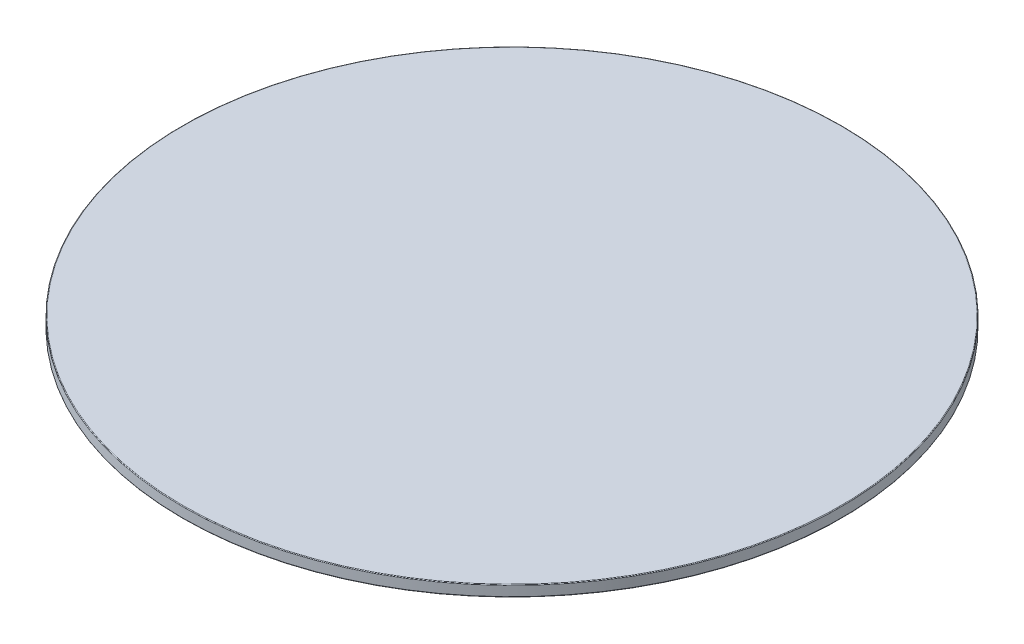
ISO-10303-21;
HEADER;
FILE_DESCRIPTION(('STEP AP214'),'2;1');
FILE_NAME('part.step','',(''),(''),'','','');
FILE_SCHEMA(('AUTOMOTIVE_DESIGN { 1 0 10303 214 1 1 1 1 }'));
ENDSEC;
DATA;
#1=APPLICATION_CONTEXT('core data for automotive mechanical design processes');
#2=APPLICATION_PROTOCOL_DEFINITION('international standard','automotive_design',2000,#1);
#3=PRODUCT_CONTEXT('',#1,'mechanical');
#4=PRODUCT('Part','Part','',(#3));
#5=PRODUCT_RELATED_PRODUCT_CATEGORY('part','',(#4));
#6=PRODUCT_DEFINITION_FORMATION('','',#4);
#7=PRODUCT_DEFINITION_CONTEXT('part definition',#1,'design');
#8=PRODUCT_DEFINITION('design','',#6,#7);
#9=PRODUCT_DEFINITION_SHAPE('','',#8);
#10=(LENGTH_UNIT() NAMED_UNIT(*) SI_UNIT(.MILLI.,.METRE.));
#11=(NAMED_UNIT(*) PLANE_ANGLE_UNIT() SI_UNIT($,.RADIAN.));
#12=(NAMED_UNIT(*) SI_UNIT($,.STERADIAN.) SOLID_ANGLE_UNIT());
#13=UNCERTAINTY_MEASURE_WITH_UNIT(LENGTH_MEASURE(1.E-05),#10,'distance_accuracy_value','');
#14=(GEOMETRIC_REPRESENTATION_CONTEXT(3) GLOBAL_UNCERTAINTY_ASSIGNED_CONTEXT((#13)) GLOBAL_UNIT_ASSIGNED_CONTEXT((#10,
#11,#12)) REPRESENTATION_CONTEXT('',''));
#15=CARTESIAN_POINT('',(0.,0.,0.));
#16=DIRECTION('',(0.,0.,1.));
#17=DIRECTION('',(1.,0.,0.));
#18=AXIS2_PLACEMENT_3D('',#15,#16,#17);
#19=CARTESIAN_POINT('',(0.,-5.,0.));
#20=DIRECTION('',(0.,1.,0.));
#21=DIRECTION('',(0.,0.,1.));
#22=AXIS2_PLACEMENT_3D('',#19,#20,#21);
#23=CYLINDRICAL_SURFACE('',#22,150.);
#24=CARTESIAN_POINT('',(0.,-0.3,0.));
#25=DIRECTION('',(0.,1.,0.));
#26=DIRECTION('',(0.,0.,1.));
#27=AXIS2_PLACEMENT_3D('',#24,#25,#26);
#28=CIRCLE('',#27,150.);
#29=CARTESIAN_POINT('',(0.,-0.3,150.));
#30=VERTEX_POINT('',#29);
#31=EDGE_CURVE('E40',#30,#30,#28,.F.);
#32=ORIENTED_EDGE('',*,*,#31,.T.);
#33=EDGE_LOOP('',(#32));
#34=FACE_BOUND('',#33,.T.);
#35=CARTESIAN_POINT('',(0.,-4.7,0.));
#36=DIRECTION('',(0.,1.,0.));
#37=DIRECTION('',(0.,0.,1.));
#38=AXIS2_PLACEMENT_3D('',#35,#36,#37);
#39=CIRCLE('',#38,150.);
#40=CARTESIAN_POINT('',(0.,-4.7,150.));
#41=VERTEX_POINT('',#40);
#42=EDGE_CURVE('E44',#41,#41,#39,.T.);
#43=ORIENTED_EDGE('',*,*,#42,.T.);
#44=EDGE_LOOP('',(#43));
#45=FACE_BOUND('',#44,.T.);
#46=ADVANCED_FACE('F33',(#34,#45),#23,.T.);
#47=CARTESIAN_POINT('',(0.,-5.,0.));
#48=DIRECTION('',(0.,1.,0.));
#49=DIRECTION('',(0.,0.,1.));
#50=AXIS2_PLACEMENT_3D('',#47,#48,#49);
#51=PLANE('',#50);
#52=CARTESIAN_POINT('',(0.,-5.,0.));
#53=DIRECTION('',(0.,1.,0.));
#54=DIRECTION('',(0.,0.,1.));
#55=AXIS2_PLACEMENT_3D('',#52,#53,#54);
#56=CIRCLE('',#55,149.7);
#57=CARTESIAN_POINT('',(0.,-5.,149.7));
#58=VERTEX_POINT('',#57);
#59=EDGE_CURVE('E10',#58,#58,#56,.F.);
#60=ORIENTED_EDGE('',*,*,#59,.T.);
#61=EDGE_LOOP('',(#60));
#62=FACE_BOUND('',#61,.T.);
#63=ADVANCED_FACE('F64',(#62),#51,.F.);
#64=CARTESIAN_POINT('',(0.,0.,0.));
#65=DIRECTION('',(0.,1.,0.));
#66=DIRECTION('',(0.,0.,1.));
#67=AXIS2_PLACEMENT_3D('',#64,#65,#66);
#68=PLANE('',#67);
#69=CARTESIAN_POINT('',(0.,0.,0.));
#70=DIRECTION('',(0.,1.,0.));
#71=DIRECTION('',(0.,0.,1.));
#72=AXIS2_PLACEMENT_3D('',#69,#70,#71);
#73=CIRCLE('',#72,149.7);
#74=CARTESIAN_POINT('',(0.,0.,149.7));
#75=VERTEX_POINT('',#74);
#76=EDGE_CURVE('E48',#75,#75,#73,.T.);
#77=ORIENTED_EDGE('',*,*,#76,.T.);
#78=EDGE_LOOP('',(#77));
#79=FACE_BOUND('',#78,.T.);
#80=ADVANCED_FACE('F54',(#79),#68,.T.);
#81=CARTESIAN_POINT('',(0.,-0.3,0.));
#82=DIRECTION('',(0.,1.,0.));
#83=DIRECTION('',(0.,0.,1.));
#84=AXIS2_PLACEMENT_3D('',#81,#82,#83);
#85=TOROIDAL_SURFACE('',#84,149.7,0.3);
#86=ORIENTED_EDGE('',*,*,#31,.F.);
#87=EDGE_LOOP('',(#86));
#88=FACE_BOUND('',#87,.T.);
#89=ORIENTED_EDGE('',*,*,#76,.F.);
#90=EDGE_LOOP('',(#89));
#91=FACE_BOUND('',#90,.T.);
#92=ADVANCED_FACE('F56',(#88,#91),#85,.T.);
#93=CARTESIAN_POINT('',(0.,-4.7,0.));
#94=DIRECTION('',(0.,1.,0.));
#95=DIRECTION('',(0.,0.,1.));
#96=AXIS2_PLACEMENT_3D('',#93,#94,#95);
#97=TOROIDAL_SURFACE('',#96,149.7,0.3);
#98=ORIENTED_EDGE('',*,*,#59,.F.);
#99=EDGE_LOOP('',(#98));
#100=FACE_BOUND('',#99,.T.);
#101=ORIENTED_EDGE('',*,*,#42,.F.);
#102=EDGE_LOOP('',(#101));
#103=FACE_BOUND('',#102,.T.);
#104=ADVANCED_FACE('F35',(#100,#103),#97,.T.);
#105=CLOSED_SHELL('',(#46,#63,#80,#92,#104));
#106=MANIFOLD_SOLID_BREP('B2',#105);
#107=ADVANCED_BREP_SHAPE_REPRESENTATION('',(#18,#106),#14);
#108=SHAPE_DEFINITION_REPRESENTATION(#9,#107);
ENDSEC;
END-ISO-10303-21;
